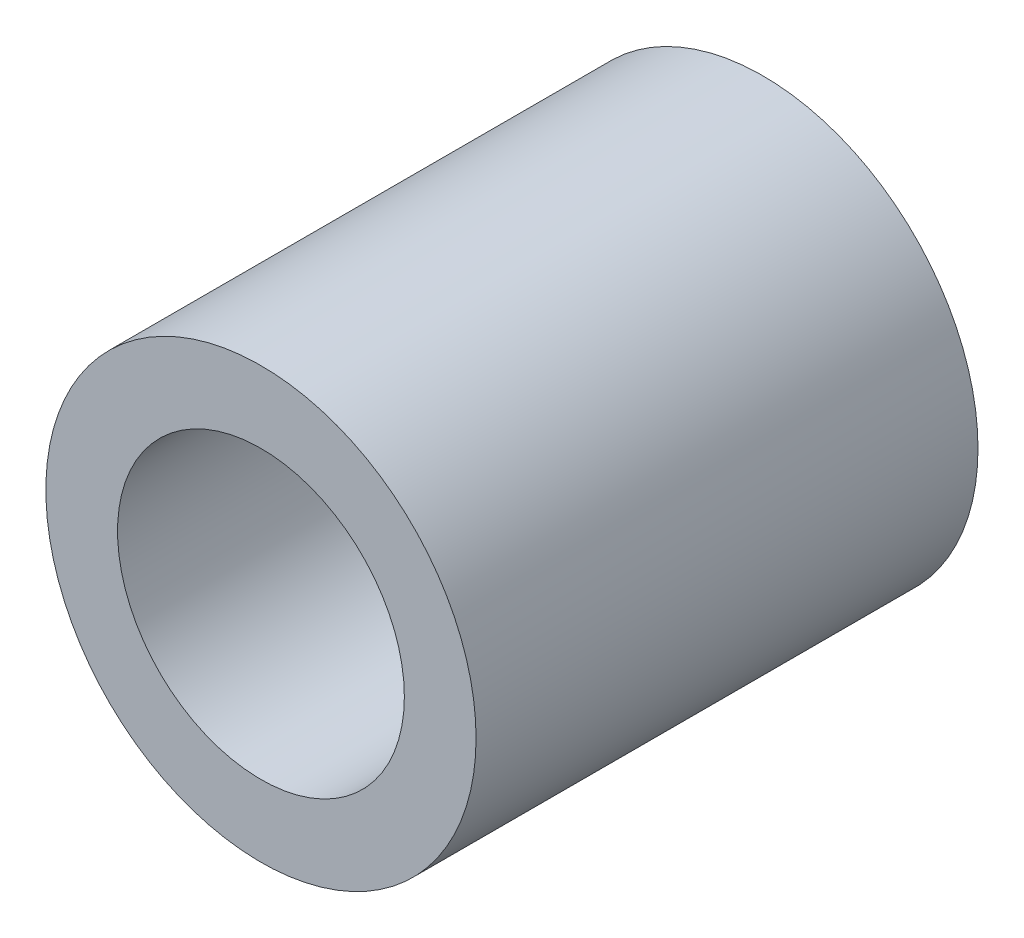
ISO-10303-21;
HEADER;
FILE_DESCRIPTION(('STEP AP214'),'2;1');
FILE_NAME('part.step','',(''),(''),'','','');
FILE_SCHEMA(('AUTOMOTIVE_DESIGN { 1 0 10303 214 1 1 1 1 }'));
ENDSEC;
DATA;
#1=APPLICATION_CONTEXT('core data for automotive mechanical design processes');
#2=APPLICATION_PROTOCOL_DEFINITION('international standard','automotive_design',2000,#1);
#3=PRODUCT_CONTEXT('',#1,'mechanical');
#4=PRODUCT('Part','Part','',(#3));
#5=PRODUCT_RELATED_PRODUCT_CATEGORY('part','',(#4));
#6=PRODUCT_DEFINITION_FORMATION('','',#4);
#7=PRODUCT_DEFINITION_CONTEXT('part definition',#1,'design');
#8=PRODUCT_DEFINITION('design','',#6,#7);
#9=PRODUCT_DEFINITION_SHAPE('','',#8);
#10=(LENGTH_UNIT() NAMED_UNIT(*) SI_UNIT(.MILLI.,.METRE.));
#11=(NAMED_UNIT(*) PLANE_ANGLE_UNIT() SI_UNIT($,.RADIAN.));
#12=(NAMED_UNIT(*) SI_UNIT($,.STERADIAN.) SOLID_ANGLE_UNIT());
#13=UNCERTAINTY_MEASURE_WITH_UNIT(LENGTH_MEASURE(1.E-05),#10,'distance_accuracy_value','');
#14=(GEOMETRIC_REPRESENTATION_CONTEXT(3) GLOBAL_UNCERTAINTY_ASSIGNED_CONTEXT((#13)) GLOBAL_UNIT_ASSIGNED_CONTEXT((#10,
#11,#12)) REPRESENTATION_CONTEXT('',''));
#15=CARTESIAN_POINT('',(0.,0.,0.));
#16=DIRECTION('',(0.,0.,1.));
#17=DIRECTION('',(1.,0.,0.));
#18=AXIS2_PLACEMENT_3D('',#15,#16,#17);
#19=CARTESIAN_POINT('',(0.,0.,3.5));
#20=DIRECTION('',(0.,0.,1.));
#21=DIRECTION('',(1.,0.,0.));
#22=AXIS2_PLACEMENT_3D('',#19,#20,#21);
#23=PLANE('',#22);
#24=CARTESIAN_POINT('',(0.,0.,3.5));
#25=DIRECTION('',(0.,0.,1.));
#26=DIRECTION('',(1.,0.,0.));
#27=AXIS2_PLACEMENT_3D('',#24,#25,#26);
#28=CIRCLE('',#27,1.5);
#29=CARTESIAN_POINT('',(1.5,0.,3.5));
#30=VERTEX_POINT('',#29);
#31=EDGE_CURVE('E10',#30,#30,#28,.T.);
#32=ORIENTED_EDGE('',*,*,#31,.T.);
#33=EDGE_LOOP('',(#32));
#34=FACE_BOUND('',#33,.T.);
#35=CARTESIAN_POINT('',(0.,0.,3.5));
#36=DIRECTION('',(0.,0.,1.));
#37=DIRECTION('',(1.,0.,0.));
#38=AXIS2_PLACEMENT_3D('',#35,#36,#37);
#39=CIRCLE('',#38,1.);
#40=CARTESIAN_POINT('',(1.,0.,3.5));
#41=VERTEX_POINT('',#40);
#42=EDGE_CURVE('E42',#41,#41,#39,.T.);
#43=ORIENTED_EDGE('',*,*,#42,.F.);
#44=EDGE_LOOP('',(#43));
#45=FACE_BOUND('',#44,.T.);
#46=ADVANCED_FACE('F31',(#34,#45),#23,.T.);
#47=CARTESIAN_POINT('',(0.,0.,0.));
#48=DIRECTION('',(0.,0.,1.));
#49=DIRECTION('',(1.,0.,0.));
#50=AXIS2_PLACEMENT_3D('',#47,#48,#49);
#51=PLANE('',#50);
#52=CARTESIAN_POINT('',(0.,0.,0.));
#53=DIRECTION('',(0.,0.,1.));
#54=DIRECTION('',(1.,0.,0.));
#55=AXIS2_PLACEMENT_3D('',#52,#53,#54);
#56=CIRCLE('',#55,1.5);
#57=CARTESIAN_POINT('',(1.5,0.,0.));
#58=VERTEX_POINT('',#57);
#59=EDGE_CURVE('E35',#58,#58,#56,.T.);
#60=ORIENTED_EDGE('',*,*,#59,.F.);
#61=EDGE_LOOP('',(#60));
#62=FACE_BOUND('',#61,.T.);
#63=CARTESIAN_POINT('',(0.,0.,0.));
#64=DIRECTION('',(0.,0.,1.));
#65=DIRECTION('',(1.,0.,0.));
#66=AXIS2_PLACEMENT_3D('',#63,#64,#65);
#67=CIRCLE('',#66,1.);
#68=CARTESIAN_POINT('',(1.,0.,0.));
#69=VERTEX_POINT('',#68);
#70=EDGE_CURVE('E44',#69,#69,#67,.T.);
#71=ORIENTED_EDGE('',*,*,#70,.T.);
#72=EDGE_LOOP('',(#71));
#73=FACE_BOUND('',#72,.T.);
#74=ADVANCED_FACE('F54',(#62,#73),#51,.F.);
#75=CARTESIAN_POINT('',(0.,0.,3.5));
#76=DIRECTION('',(0.,0.,-1.));
#77=DIRECTION('',(-1.,0.,0.));
#78=AXIS2_PLACEMENT_3D('',#75,#76,#77);
#79=CYLINDRICAL_SURFACE('',#78,1.5);
#80=ORIENTED_EDGE('',*,*,#31,.F.);
#81=EDGE_LOOP('',(#80));
#82=FACE_BOUND('',#81,.T.);
#83=ORIENTED_EDGE('',*,*,#59,.T.);
#84=EDGE_LOOP('',(#83));
#85=FACE_BOUND('',#84,.T.);
#86=ADVANCED_FACE('F33',(#82,#85),#79,.T.);
#87=CARTESIAN_POINT('',(0.,0.,3.5));
#88=DIRECTION('',(0.,0.,-1.));
#89=DIRECTION('',(-1.,0.,0.));
#90=AXIS2_PLACEMENT_3D('',#87,#88,#89);
#91=CYLINDRICAL_SURFACE('',#90,1.);
#92=ORIENTED_EDGE('',*,*,#42,.T.);
#93=EDGE_LOOP('',(#92));
#94=FACE_BOUND('',#93,.T.);
#95=ORIENTED_EDGE('',*,*,#70,.F.);
#96=EDGE_LOOP('',(#95));
#97=FACE_BOUND('',#96,.T.);
#98=ADVANCED_FACE('F50',(#94,#97),#91,.F.);
#99=CLOSED_SHELL('',(#46,#74,#86,#98));
#100=MANIFOLD_SOLID_BREP('B2',#99);
#101=ADVANCED_BREP_SHAPE_REPRESENTATION('',(#18,#100),#14);
#102=SHAPE_DEFINITION_REPRESENTATION(#9,#101);
ENDSEC;
END-ISO-10303-21;
